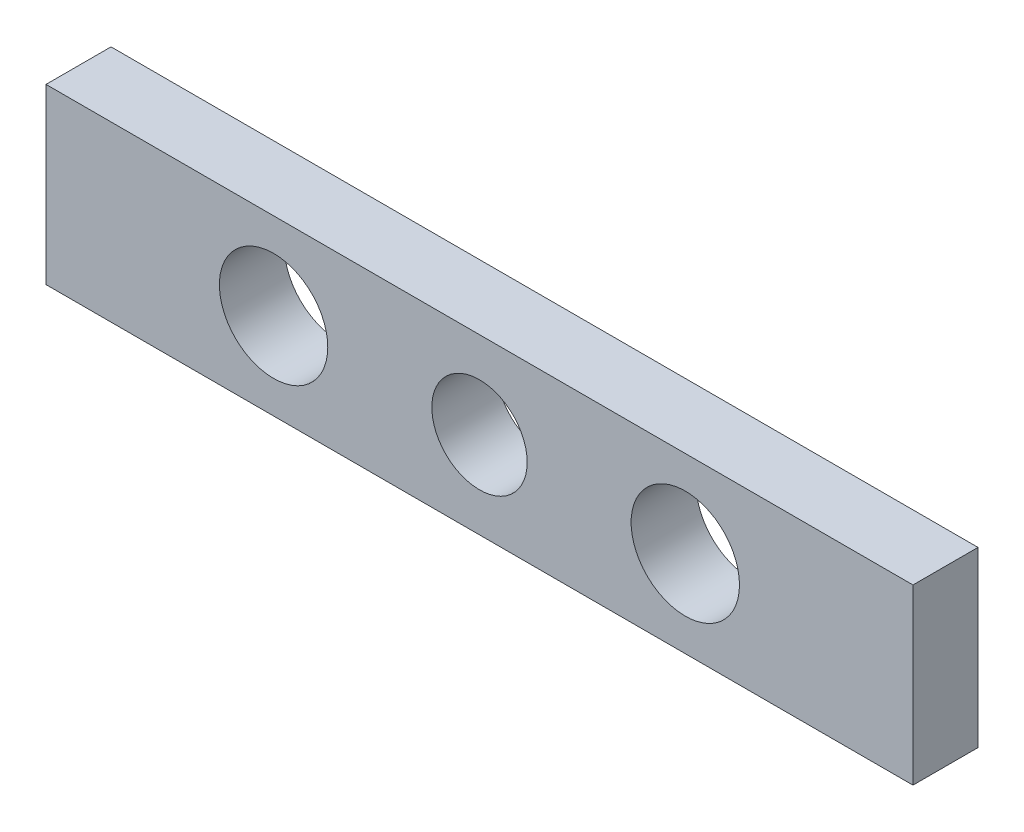
ISO-10303-21;
HEADER;
FILE_DESCRIPTION(('STEP AP214'),'2;1');
FILE_NAME('part.step','',(''),(''),'','','');
FILE_SCHEMA(('AUTOMOTIVE_DESIGN { 1 0 10303 214 1 1 1 1 }'));
ENDSEC;
DATA;
#1=APPLICATION_CONTEXT('core data for automotive mechanical design processes');
#2=APPLICATION_PROTOCOL_DEFINITION('international standard','automotive_design',2000,#1);
#3=PRODUCT_CONTEXT('',#1,'mechanical');
#4=PRODUCT('Part','Part','',(#3));
#5=PRODUCT_RELATED_PRODUCT_CATEGORY('part','',(#4));
#6=PRODUCT_DEFINITION_FORMATION('','',#4);
#7=PRODUCT_DEFINITION_CONTEXT('part definition',#1,'design');
#8=PRODUCT_DEFINITION('design','',#6,#7);
#9=PRODUCT_DEFINITION_SHAPE('','',#8);
#10=(LENGTH_UNIT() NAMED_UNIT(*) SI_UNIT(.MILLI.,.METRE.));
#11=(NAMED_UNIT(*) PLANE_ANGLE_UNIT() SI_UNIT($,.RADIAN.));
#12=(NAMED_UNIT(*) SI_UNIT($,.STERADIAN.) SOLID_ANGLE_UNIT());
#13=UNCERTAINTY_MEASURE_WITH_UNIT(LENGTH_MEASURE(1.E-05),#10,'distance_accuracy_value','');
#14=(GEOMETRIC_REPRESENTATION_CONTEXT(3) GLOBAL_UNCERTAINTY_ASSIGNED_CONTEXT((#13)) GLOBAL_UNIT_ASSIGNED_CONTEXT((#10,
#11,#12)) REPRESENTATION_CONTEXT('',''));
#15=CARTESIAN_POINT('',(0.,0.,0.));
#16=DIRECTION('',(0.,0.,1.));
#17=DIRECTION('',(1.,0.,0.));
#18=AXIS2_PLACEMENT_3D('',#15,#16,#17);
#19=CARTESIAN_POINT('',(0.,4.99999999999999,3.));
#20=DIRECTION('',(0.,-1.,0.));
#21=DIRECTION('',(1.,0.,0.));
#22=AXIS2_PLACEMENT_3D('',#19,#20,#21);
#23=PLANE('',#22);
#24=DIRECTION('',(-1.,0.,0.));
#25=VECTOR('',#24,1.);
#26=CARTESIAN_POINT('',(0.,4.99999999999999,0.));
#27=LINE('',#26,#25);
#28=CARTESIAN_POINT('',(20.0022631326355,4.99999999999999,0.));
#29=VERTEX_POINT('',#28);
#30=CARTESIAN_POINT('',(-19.9977368673645,4.99999999999999,0.));
#31=VERTEX_POINT('',#30);
#32=EDGE_CURVE('E144',#29,#31,#27,.T.);
#33=ORIENTED_EDGE('',*,*,#32,.T.);
#34=DIRECTION('',(0.,0.,-1.));
#35=VECTOR('',#34,1.);
#36=CARTESIAN_POINT('',(-19.9977368673645,4.99999999999999,3.));
#37=LINE('',#36,#35);
#38=CARTESIAN_POINT('',(-19.9977368673645,4.99999999999999,3.));
#39=VERTEX_POINT('',#38);
#40=EDGE_CURVE('E12',#39,#31,#37,.T.);
#41=ORIENTED_EDGE('',*,*,#40,.F.);
#42=DIRECTION('',(-1.,0.,0.));
#43=VECTOR('',#42,1.);
#44=CARTESIAN_POINT('',(0.,4.99999999999999,3.));
#45=LINE('',#44,#43);
#46=CARTESIAN_POINT('',(20.0022631326355,4.99999999999999,3.));
#47=VERTEX_POINT('',#46);
#48=EDGE_CURVE('E88',#47,#39,#45,.T.);
#49=ORIENTED_EDGE('',*,*,#48,.F.);
#50=DIRECTION('',(0.,0.,-1.));
#51=VECTOR('',#50,1.);
#52=CARTESIAN_POINT('',(20.0022631326355,4.99999999999999,3.));
#53=LINE('',#52,#51);
#54=EDGE_CURVE('E54',#47,#29,#53,.T.);
#55=ORIENTED_EDGE('',*,*,#54,.T.);
#56=EDGE_LOOP('',(#33,#41,#49,#55));
#57=FACE_BOUND('',#56,.T.);
#58=ADVANCED_FACE('F37',(#57),#23,.F.);
#59=CARTESIAN_POINT('',(-19.9977368673645,0.,3.));
#60=DIRECTION('',(1.,0.,0.));
#61=DIRECTION('',(0.,1.,0.));
#62=AXIS2_PLACEMENT_3D('',#59,#60,#61);
#63=PLANE('',#62);
#64=DIRECTION('',(0.,-1.,0.));
#65=VECTOR('',#64,1.);
#66=CARTESIAN_POINT('',(-19.9977368673645,0.,0.));
#67=LINE('',#66,#65);
#68=CARTESIAN_POINT('',(-19.9977368673645,-3.00000000000001,0.));
#69=VERTEX_POINT('',#68);
#70=EDGE_CURVE('E93',#31,#69,#67,.T.);
#71=ORIENTED_EDGE('',*,*,#70,.T.);
#72=DIRECTION('',(0.,0.,-1.));
#73=VECTOR('',#72,1.);
#74=CARTESIAN_POINT('',(-19.9977368673645,-3.00000000000001,3.));
#75=LINE('',#74,#73);
#76=CARTESIAN_POINT('',(-19.9977368673645,-3.00000000000001,3.));
#77=VERTEX_POINT('',#76);
#78=EDGE_CURVE('E46',#77,#69,#75,.T.);
#79=ORIENTED_EDGE('',*,*,#78,.F.);
#80=DIRECTION('',(0.,-1.,0.));
#81=VECTOR('',#80,1.);
#82=CARTESIAN_POINT('',(-19.9977368673645,0.,3.));
#83=LINE('',#82,#81);
#84=EDGE_CURVE('E79',#39,#77,#83,.T.);
#85=ORIENTED_EDGE('',*,*,#84,.F.);
#86=ORIENTED_EDGE('',*,*,#40,.T.);
#87=EDGE_LOOP('',(#71,#79,#85,#86));
#88=FACE_BOUND('',#87,.T.);
#89=ADVANCED_FACE('F92',(#88),#63,.F.);
#90=CARTESIAN_POINT('',(0.,-3.00000000000001,3.));
#91=DIRECTION('',(0.,-1.,0.));
#92=DIRECTION('',(1.,0.,0.));
#93=AXIS2_PLACEMENT_3D('',#90,#91,#92);
#94=PLANE('',#93);
#95=DIRECTION('',(-1.,0.,0.));
#96=VECTOR('',#95,1.);
#97=CARTESIAN_POINT('',(0.,-3.00000000000001,0.));
#98=LINE('',#97,#96);
#99=CARTESIAN_POINT('',(20.0022631326355,-3.,0.));
#100=VERTEX_POINT('',#99);
#101=EDGE_CURVE('E128',#100,#69,#98,.T.);
#102=ORIENTED_EDGE('',*,*,#101,.F.);
#103=DIRECTION('',(0.,0.,-1.));
#104=VECTOR('',#103,1.);
#105=CARTESIAN_POINT('',(20.0022631326355,-3.,3.));
#106=LINE('',#105,#104);
#107=CARTESIAN_POINT('',(20.0022631326355,-3.,3.));
#108=VERTEX_POINT('',#107);
#109=EDGE_CURVE('E68',#108,#100,#106,.T.);
#110=ORIENTED_EDGE('',*,*,#109,.F.);
#111=DIRECTION('',(-1.,0.,0.));
#112=VECTOR('',#111,1.);
#113=CARTESIAN_POINT('',(0.,-3.00000000000001,3.));
#114=LINE('',#113,#112);
#115=EDGE_CURVE('E87',#108,#77,#114,.T.);
#116=ORIENTED_EDGE('',*,*,#115,.T.);
#117=ORIENTED_EDGE('',*,*,#78,.T.);
#118=EDGE_LOOP('',(#102,#110,#116,#117));
#119=FACE_BOUND('',#118,.T.);
#120=ADVANCED_FACE('F96',(#119),#94,.T.);
#121=CARTESIAN_POINT('',(20.0022631326355,0.,3.));
#122=DIRECTION('',(1.,0.,0.));
#123=DIRECTION('',(0.,1.,0.));
#124=AXIS2_PLACEMENT_3D('',#121,#122,#123);
#125=PLANE('',#124);
#126=DIRECTION('',(0.,-1.,0.));
#127=VECTOR('',#126,1.);
#128=CARTESIAN_POINT('',(20.0022631326355,0.,0.));
#129=LINE('',#128,#127);
#130=EDGE_CURVE('E123',#29,#100,#129,.T.);
#131=ORIENTED_EDGE('',*,*,#130,.F.);
#132=ORIENTED_EDGE('',*,*,#54,.F.);
#133=DIRECTION('',(0.,-1.,0.));
#134=VECTOR('',#133,1.);
#135=CARTESIAN_POINT('',(20.0022631326355,0.,3.));
#136=LINE('',#135,#134);
#137=EDGE_CURVE('E97',#47,#108,#136,.T.);
#138=ORIENTED_EDGE('',*,*,#137,.T.);
#139=ORIENTED_EDGE('',*,*,#109,.T.);
#140=EDGE_LOOP('',(#131,#132,#138,#139));
#141=FACE_BOUND('',#140,.T.);
#142=ADVANCED_FACE('F148',(#141),#125,.T.);
#143=CARTESIAN_POINT('',(9.49773686736451,0.999999999999997,3.));
#144=DIRECTION('',(0.,0.,-1.));
#145=DIRECTION('',(-1.,0.,0.));
#146=AXIS2_PLACEMENT_3D('',#143,#144,#145);
#147=CYLINDRICAL_SURFACE('',#146,2.5);
#148=CARTESIAN_POINT('',(9.49773686736451,0.999999999999997,3.));
#149=DIRECTION('',(0.,0.,1.));
#150=DIRECTION('',(1.,0.,0.));
#151=AXIS2_PLACEMENT_3D('',#148,#149,#150);
#152=CIRCLE('',#151,2.5);
#153=CARTESIAN_POINT('',(11.9977368673645,0.999999999999997,3.));
#154=VERTEX_POINT('',#153);
#155=EDGE_CURVE('E112',#154,#154,#152,.T.);
#156=ORIENTED_EDGE('',*,*,#155,.T.);
#157=EDGE_LOOP('',(#156));
#158=FACE_BOUND('',#157,.T.);
#159=CARTESIAN_POINT('',(9.49773686736451,0.999999999999997,0.));
#160=DIRECTION('',(0.,0.,1.));
#161=DIRECTION('',(1.,0.,0.));
#162=AXIS2_PLACEMENT_3D('',#159,#160,#161);
#163=CIRCLE('',#162,2.5);
#164=CARTESIAN_POINT('',(11.9977368673645,0.999999999999997,0.));
#165=VERTEX_POINT('',#164);
#166=EDGE_CURVE('E141',#165,#165,#163,.T.);
#167=ORIENTED_EDGE('',*,*,#166,.F.);
#168=EDGE_LOOP('',(#167));
#169=FACE_BOUND('',#168,.T.);
#170=ADVANCED_FACE('F150',(#158,#169),#147,.F.);
#171=CARTESIAN_POINT('',(0.00226313263548827,1.,3.));
#172=DIRECTION('',(0.,0.,-1.));
#173=DIRECTION('',(-1.,0.,0.));
#174=AXIS2_PLACEMENT_3D('',#171,#172,#173);
#175=CYLINDRICAL_SURFACE('',#174,2.2);
#176=CARTESIAN_POINT('',(0.00226313263548827,1.,3.));
#177=DIRECTION('',(0.,0.,1.));
#178=DIRECTION('',(1.,0.,0.));
#179=AXIS2_PLACEMENT_3D('',#176,#177,#178);
#180=CIRCLE('',#179,2.2);
#181=CARTESIAN_POINT('',(2.20226313263549,1.,3.));
#182=VERTEX_POINT('',#181);
#183=EDGE_CURVE('E116',#182,#182,#180,.T.);
#184=ORIENTED_EDGE('',*,*,#183,.T.);
#185=EDGE_LOOP('',(#184));
#186=FACE_BOUND('',#185,.T.);
#187=CARTESIAN_POINT('',(0.00226313263548827,1.,0.));
#188=DIRECTION('',(0.,0.,1.));
#189=DIRECTION('',(1.,0.,0.));
#190=AXIS2_PLACEMENT_3D('',#187,#188,#189);
#191=CIRCLE('',#190,2.2);
#192=CARTESIAN_POINT('',(2.20226313263549,1.,0.));
#193=VERTEX_POINT('',#192);
#194=EDGE_CURVE('E138',#193,#193,#191,.T.);
#195=ORIENTED_EDGE('',*,*,#194,.F.);
#196=EDGE_LOOP('',(#195));
#197=FACE_BOUND('',#196,.T.);
#198=ADVANCED_FACE('F39',(#186,#197),#175,.F.);
#199=CARTESIAN_POINT('',(-9.49773686736455,0.999999999999991,3.));
#200=DIRECTION('',(0.,0.,-1.));
#201=DIRECTION('',(-1.,0.,0.));
#202=AXIS2_PLACEMENT_3D('',#199,#200,#201);
#203=CYLINDRICAL_SURFACE('',#202,2.49999999999997);
#204=CARTESIAN_POINT('',(-9.49773686736455,0.999999999999991,3.));
#205=DIRECTION('',(0.,0.,1.));
#206=DIRECTION('',(1.,0.,0.));
#207=AXIS2_PLACEMENT_3D('',#204,#205,#206);
#208=CIRCLE('',#207,2.49999999999997);
#209=CARTESIAN_POINT('',(-6.99773686736458,0.999999999999991,3.));
#210=VERTEX_POINT('',#209);
#211=EDGE_CURVE('E99',#210,#210,#208,.T.);
#212=ORIENTED_EDGE('',*,*,#211,.T.);
#213=EDGE_LOOP('',(#212));
#214=FACE_BOUND('',#213,.T.);
#215=CARTESIAN_POINT('',(-9.49773686736455,0.999999999999991,0.));
#216=DIRECTION('',(0.,0.,1.));
#217=DIRECTION('',(1.,0.,0.));
#218=AXIS2_PLACEMENT_3D('',#215,#216,#217);
#219=CIRCLE('',#218,2.49999999999997);
#220=CARTESIAN_POINT('',(-6.99773686736458,0.999999999999991,0.));
#221=VERTEX_POINT('',#220);
#222=EDGE_CURVE('E119',#221,#221,#219,.T.);
#223=ORIENTED_EDGE('',*,*,#222,.F.);
#224=EDGE_LOOP('',(#223));
#225=FACE_BOUND('',#224,.T.);
#226=ADVANCED_FACE('F192',(#214,#225),#203,.F.);
#227=CARTESIAN_POINT('',(0.,0.,3.));
#228=DIRECTION('',(0.,0.,1.));
#229=DIRECTION('',(1.,0.,0.));
#230=AXIS2_PLACEMENT_3D('',#227,#228,#229);
#231=PLANE('',#230);
#232=ORIENTED_EDGE('',*,*,#183,.F.);
#233=EDGE_LOOP('',(#232));
#234=FACE_BOUND('',#233,.T.);
#235=ORIENTED_EDGE('',*,*,#155,.F.);
#236=EDGE_LOOP('',(#235));
#237=FACE_BOUND('',#236,.T.);
#238=ORIENTED_EDGE('',*,*,#48,.T.);
#239=ORIENTED_EDGE('',*,*,#84,.T.);
#240=ORIENTED_EDGE('',*,*,#115,.F.);
#241=ORIENTED_EDGE('',*,*,#137,.F.);
#242=EDGE_LOOP('',(#238,#239,#240,#241));
#243=FACE_BOUND('',#242,.T.);
#244=ORIENTED_EDGE('',*,*,#211,.F.);
#245=EDGE_LOOP('',(#244));
#246=FACE_BOUND('',#245,.T.);
#247=ADVANCED_FACE('F83',(#234,#237,#243,#246),#231,.T.);
#248=CARTESIAN_POINT('',(0.,0.,0.));
#249=DIRECTION('',(0.,0.,1.));
#250=DIRECTION('',(1.,0.,0.));
#251=AXIS2_PLACEMENT_3D('',#248,#249,#250);
#252=PLANE('',#251);
#253=ORIENTED_EDGE('',*,*,#194,.T.);
#254=EDGE_LOOP('',(#253));
#255=FACE_BOUND('',#254,.T.);
#256=ORIENTED_EDGE('',*,*,#166,.T.);
#257=EDGE_LOOP('',(#256));
#258=FACE_BOUND('',#257,.T.);
#259=ORIENTED_EDGE('',*,*,#32,.F.);
#260=ORIENTED_EDGE('',*,*,#130,.T.);
#261=ORIENTED_EDGE('',*,*,#101,.T.);
#262=ORIENTED_EDGE('',*,*,#70,.F.);
#263=EDGE_LOOP('',(#259,#260,#261,#262));
#264=FACE_BOUND('',#263,.T.);
#265=ORIENTED_EDGE('',*,*,#222,.T.);
#266=EDGE_LOOP('',(#265));
#267=FACE_BOUND('',#266,.T.);
#268=ADVANCED_FACE('F147',(#255,#258,#264,#267),#252,.F.);
#269=CLOSED_SHELL('',(#58,#89,#120,#142,#170,#198,#226,#247,#268));
#270=MANIFOLD_SOLID_BREP('B2',#269);
#271=ADVANCED_BREP_SHAPE_REPRESENTATION('',(#18,#270),#14);
#272=SHAPE_DEFINITION_REPRESENTATION(#9,#271);
ENDSEC;
END-ISO-10303-21;
